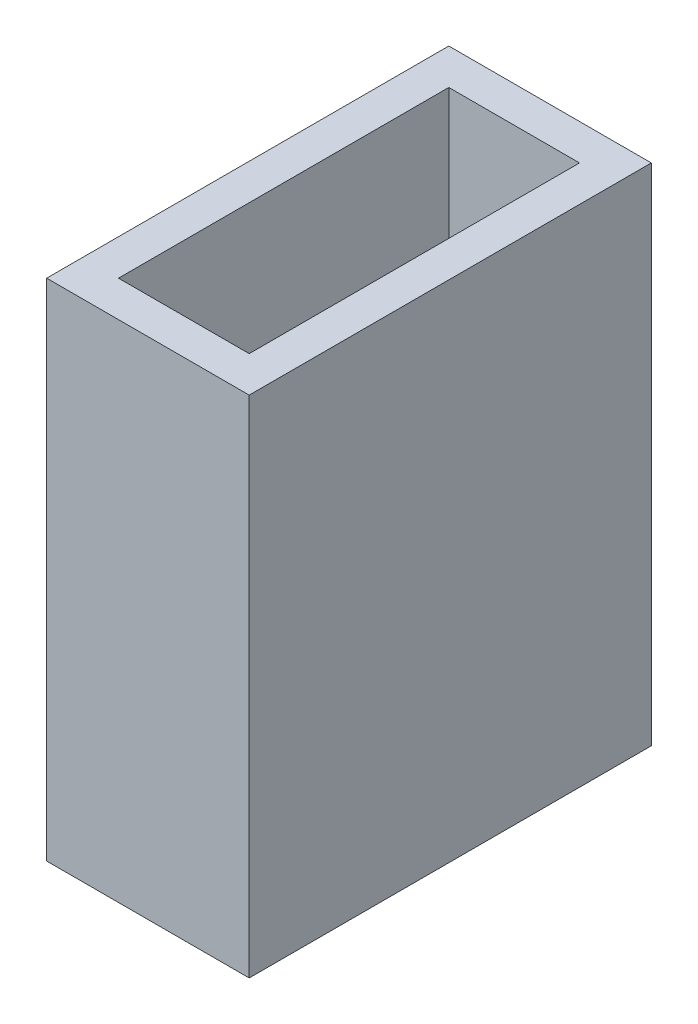
ISO-10303-21;
HEADER;
FILE_DESCRIPTION(('STEP AP214'),'2;1');
FILE_NAME('part.step','',(''),(''),'','','');
FILE_SCHEMA(('AUTOMOTIVE_DESIGN { 1 0 10303 214 1 1 1 1 }'));
ENDSEC;
DATA;
#1=APPLICATION_CONTEXT('core data for automotive mechanical design processes');
#2=APPLICATION_PROTOCOL_DEFINITION('international standard','automotive_design',2000,#1);
#3=PRODUCT_CONTEXT('',#1,'mechanical');
#4=PRODUCT('Part','Part','',(#3));
#5=PRODUCT_RELATED_PRODUCT_CATEGORY('part','',(#4));
#6=PRODUCT_DEFINITION_FORMATION('','',#4);
#7=PRODUCT_DEFINITION_CONTEXT('part definition',#1,'design');
#8=PRODUCT_DEFINITION('design','',#6,#7);
#9=PRODUCT_DEFINITION_SHAPE('','',#8);
#10=(LENGTH_UNIT() NAMED_UNIT(*) SI_UNIT(.MILLI.,.METRE.));
#11=(NAMED_UNIT(*) PLANE_ANGLE_UNIT() SI_UNIT($,.RADIAN.));
#12=(NAMED_UNIT(*) SI_UNIT($,.STERADIAN.) SOLID_ANGLE_UNIT());
#13=UNCERTAINTY_MEASURE_WITH_UNIT(LENGTH_MEASURE(1.E-05),#10,'distance_accuracy_value','');
#14=(GEOMETRIC_REPRESENTATION_CONTEXT(3) GLOBAL_UNCERTAINTY_ASSIGNED_CONTEXT((#13)) GLOBAL_UNIT_ASSIGNED_CONTEXT((#10,
#11,#12)) REPRESENTATION_CONTEXT('',''));
#15=CARTESIAN_POINT('',(0.,0.,0.));
#16=DIRECTION('',(0.,0.,1.));
#17=DIRECTION('',(1.,0.,0.));
#18=AXIS2_PLACEMENT_3D('',#15,#16,#17);
#19=CARTESIAN_POINT('',(13.7040842537851,8.52335897075654,-35.1934434793238));
#20=DIRECTION('',(0.,0.,-1.));
#21=DIRECTION('',(-1.,0.,0.));
#22=AXIS2_PLACEMENT_3D('',#19,#20,#21);
#23=PLANE('',#22);
#24=DIRECTION('',(-1.,0.,0.));
#25=VECTOR('',#24,1.);
#26=CARTESIAN_POINT('',(13.7040842537851,2.17335897773504,-35.1934434793238));
#27=LINE('',#26,#25);
#28=CARTESIAN_POINT('',(15.3483616467974,2.17335897773504,-35.1934434793238));
#29=VERTEX_POINT('',#28);
#30=CARTESIAN_POINT('',(13.7040842537851,2.17335897773504,-35.1934434793238));
#31=VERTEX_POINT('',#30);
#32=EDGE_CURVE('E90',#29,#31,#27,.T.);
#33=ORIENTED_EDGE('',*,*,#32,.T.);
#34=DIRECTION('',(0.,1.,0.));
#35=VECTOR('',#34,1.);
#36=CARTESIAN_POINT('',(13.7040842537851,8.52335897075654,-35.1934434793238));
#37=LINE('',#36,#35);
#38=CARTESIAN_POINT('',(13.7040842537851,8.52335897075654,-35.1934434793238));
#39=VERTEX_POINT('',#38);
#40=EDGE_CURVE('E92',#39,#31,#37,.F.);
#41=ORIENTED_EDGE('',*,*,#40,.F.);
#42=DIRECTION('',(-1.,0.,0.));
#43=VECTOR('',#42,1.);
#44=CARTESIAN_POINT('',(13.7040842537851,8.52335897075654,-35.1934434793238));
#45=LINE('',#44,#43);
#46=CARTESIAN_POINT('',(15.3483616467974,8.52335897075654,-35.1934434793238));
#47=VERTEX_POINT('',#46);
#48=EDGE_CURVE('E20',#39,#47,#45,.F.);
#49=ORIENTED_EDGE('',*,*,#48,.T.);
#50=DIRECTION('',(0.,-1.,0.));
#51=VECTOR('',#50,1.);
#52=CARTESIAN_POINT('',(15.3483616467974,8.52335897075654,-35.1934434793238));
#53=LINE('',#52,#51);
#54=EDGE_CURVE('E97',#29,#47,#53,.F.);
#55=ORIENTED_EDGE('',*,*,#54,.F.);
#56=EDGE_LOOP('',(#33,#41,#49,#55));
#57=FACE_BOUND('',#56,.T.);
#58=ADVANCED_FACE('F17',(#57),#23,.T.);
#59=CARTESIAN_POINT('',(15.3483616467974,8.52335897075654,-39.3483599932868));
#60=DIRECTION('',(0.,0.,1.));
#61=DIRECTION('',(1.,0.,0.));
#62=AXIS2_PLACEMENT_3D('',#59,#60,#61);
#63=PLANE('',#62);
#64=DIRECTION('',(1.,0.,0.));
#65=VECTOR('',#64,1.);
#66=CARTESIAN_POINT('',(15.3483616467974,2.17335897773504,-39.3483599932868));
#67=LINE('',#66,#65);
#68=CARTESIAN_POINT('',(13.7040842537851,2.17335897773504,-39.3483599932868));
#69=VERTEX_POINT('',#68);
#70=CARTESIAN_POINT('',(15.3483616467974,2.17335897773504,-39.3483599932868));
#71=VERTEX_POINT('',#70);
#72=EDGE_CURVE('E114',#69,#71,#67,.T.);
#73=ORIENTED_EDGE('',*,*,#72,.T.);
#74=DIRECTION('',(0.,-1.,0.));
#75=VECTOR('',#74,1.);
#76=CARTESIAN_POINT('',(15.3483616467974,8.52335897075654,-39.3483599932868));
#77=LINE('',#76,#75);
#78=CARTESIAN_POINT('',(15.3483616467974,8.52335897075654,-39.3483599932868));
#79=VERTEX_POINT('',#78);
#80=EDGE_CURVE('E111',#79,#71,#77,.T.);
#81=ORIENTED_EDGE('',*,*,#80,.F.);
#82=DIRECTION('',(1.,0.,0.));
#83=VECTOR('',#82,1.);
#84=CARTESIAN_POINT('',(15.3483616467974,8.52335897075654,-39.3483599932868));
#85=LINE('',#84,#83);
#86=CARTESIAN_POINT('',(13.7040842537851,8.52335897075654,-39.3483599932868));
#87=VERTEX_POINT('',#86);
#88=EDGE_CURVE('E116',#79,#87,#85,.F.);
#89=ORIENTED_EDGE('',*,*,#88,.T.);
#90=DIRECTION('',(0.,1.,0.));
#91=VECTOR('',#90,1.);
#92=CARTESIAN_POINT('',(13.7040842537851,8.52335897075654,-39.3483599932868));
#93=LINE('',#92,#91);
#94=EDGE_CURVE('E96',#69,#87,#93,.T.);
#95=ORIENTED_EDGE('',*,*,#94,.F.);
#96=EDGE_LOOP('',(#73,#81,#89,#95));
#97=FACE_BOUND('',#96,.T.);
#98=ADVANCED_FACE('F119',(#97),#63,.T.);
#99=CARTESIAN_POINT('',(15.3483616467974,8.52335897075654,-35.1934434793238));
#100=DIRECTION('',(-1.,0.,0.));
#101=DIRECTION('',(0.,-1.,0.));
#102=AXIS2_PLACEMENT_3D('',#99,#100,#101);
#103=PLANE('',#102);
#104=DIRECTION('',(0.,0.,1.));
#105=VECTOR('',#104,1.);
#106=CARTESIAN_POINT('',(15.3483616467974,2.17335897773504,-37.2709017363053));
#107=LINE('',#106,#105);
#108=EDGE_CURVE('E124',#29,#71,#107,.F.);
#109=ORIENTED_EDGE('',*,*,#108,.F.);
#110=ORIENTED_EDGE('',*,*,#54,.T.);
#111=DIRECTION('',(0.,0.,1.));
#112=VECTOR('',#111,1.);
#113=CARTESIAN_POINT('',(15.3483616467974,8.52335897075654,-37.2709017363053));
#114=LINE('',#113,#112);
#115=EDGE_CURVE('E89',#79,#47,#114,.T.);
#116=ORIENTED_EDGE('',*,*,#115,.F.);
#117=ORIENTED_EDGE('',*,*,#80,.T.);
#118=EDGE_LOOP('',(#109,#110,#116,#117));
#119=FACE_BOUND('',#118,.T.);
#120=ADVANCED_FACE('F123',(#119),#103,.T.);
#121=CARTESIAN_POINT('',(13.7040842537851,8.52335897075654,-39.3483599932868));
#122=DIRECTION('',(1.,0.,0.));
#123=DIRECTION('',(0.,1.,0.));
#124=AXIS2_PLACEMENT_3D('',#121,#122,#123);
#125=PLANE('',#124);
#126=DIRECTION('',(0.,0.,1.));
#127=VECTOR('',#126,1.);
#128=CARTESIAN_POINT('',(13.7040842537851,2.17335897773504,-37.2709017363053));
#129=LINE('',#128,#127);
#130=EDGE_CURVE('E126',#69,#31,#129,.T.);
#131=ORIENTED_EDGE('',*,*,#130,.F.);
#132=ORIENTED_EDGE('',*,*,#94,.T.);
#133=DIRECTION('',(0.,0.,1.));
#134=VECTOR('',#133,1.);
#135=CARTESIAN_POINT('',(13.7040842537851,8.52335897075654,-37.2709017363053));
#136=LINE('',#135,#134);
#137=EDGE_CURVE('E87',#39,#87,#136,.F.);
#138=ORIENTED_EDGE('',*,*,#137,.F.);
#139=ORIENTED_EDGE('',*,*,#40,.T.);
#140=EDGE_LOOP('',(#131,#132,#138,#139));
#141=FACE_BOUND('',#140,.T.);
#142=ADVANCED_FACE('F100',(#141),#125,.T.);
#143=CARTESIAN_POINT('',(13.2524461891814,8.52335897075654,-34.7418054147201));
#144=DIRECTION('',(-1.,0.,0.));
#145=DIRECTION('',(0.,-1.,0.));
#146=AXIS2_PLACEMENT_3D('',#143,#144,#145);
#147=PLANE('',#146);
#148=DIRECTION('',(0.,0.,1.));
#149=VECTOR('',#148,1.);
#150=CARTESIAN_POINT('',(13.2524461891814,2.17335897773504,-37.2709017363053));
#151=LINE('',#150,#149);
#152=CARTESIAN_POINT('',(13.2524461891814,2.17335897773504,-34.7418054147201));
#153=VERTEX_POINT('',#152);
#154=CARTESIAN_POINT('',(13.2524461891814,2.17335897773504,-39.7999980578905));
#155=VERTEX_POINT('',#154);
#156=EDGE_CURVE('E127',#153,#155,#151,.F.);
#157=ORIENTED_EDGE('',*,*,#156,.F.);
#158=DIRECTION('',(0.,1.,0.));
#159=VECTOR('',#158,1.);
#160=CARTESIAN_POINT('',(13.2524461891814,8.52335897075654,-34.7418054147201));
#161=LINE('',#160,#159);
#162=CARTESIAN_POINT('',(13.2524461891814,8.52335897075654,-34.7418054147201));
#163=VERTEX_POINT('',#162);
#164=EDGE_CURVE('E137',#163,#153,#161,.F.);
#165=ORIENTED_EDGE('',*,*,#164,.F.);
#166=DIRECTION('',(0.,0.,1.));
#167=VECTOR('',#166,1.);
#168=CARTESIAN_POINT('',(13.2524461891814,8.52335897075654,-37.2709017363053));
#169=LINE('',#168,#167);
#170=CARTESIAN_POINT('',(13.2524461891814,8.52335897075654,-39.7999980578905));
#171=VERTEX_POINT('',#170);
#172=EDGE_CURVE('E102',#171,#163,#169,.T.);
#173=ORIENTED_EDGE('',*,*,#172,.F.);
#174=DIRECTION('',(0.,1.,0.));
#175=VECTOR('',#174,1.);
#176=CARTESIAN_POINT('',(13.2524461891814,8.52335897075653,-39.7999980578905));
#177=LINE('',#176,#175);
#178=EDGE_CURVE('E154',#155,#171,#177,.T.);
#179=ORIENTED_EDGE('',*,*,#178,.F.);
#180=EDGE_LOOP('',(#157,#165,#173,#179));
#181=FACE_BOUND('',#180,.T.);
#182=ADVANCED_FACE('F153',(#181),#147,.T.);
#183=CARTESIAN_POINT('',(14.5262229502912,8.52335897075654,-37.2709017363053));
#184=DIRECTION('',(0.,1.,0.));
#185=DIRECTION('',(-1.,0.,0.));
#186=AXIS2_PLACEMENT_3D('',#183,#184,#185);
#187=PLANE('',#186);
#188=ORIENTED_EDGE('',*,*,#88,.F.);
#189=ORIENTED_EDGE('',*,*,#115,.T.);
#190=ORIENTED_EDGE('',*,*,#48,.F.);
#191=ORIENTED_EDGE('',*,*,#137,.T.);
#192=EDGE_LOOP('',(#188,#189,#190,#191));
#193=FACE_BOUND('',#192,.T.);
#194=ORIENTED_EDGE('',*,*,#172,.T.);
#195=DIRECTION('',(1.,0.,0.));
#196=VECTOR('',#195,1.);
#197=CARTESIAN_POINT('',(15.7999997114011,8.52335897075654,-34.7418054147201));
#198=LINE('',#197,#196);
#199=CARTESIAN_POINT('',(15.7999997114011,8.52335897075654,-34.7418054147201));
#200=VERTEX_POINT('',#199);
#201=EDGE_CURVE('E104',#200,#163,#198,.F.);
#202=ORIENTED_EDGE('',*,*,#201,.F.);
#203=DIRECTION('',(0.,0.,1.));
#204=VECTOR('',#203,1.);
#205=CARTESIAN_POINT('',(15.7999997114011,8.52335897075654,-39.7999980578905));
#206=LINE('',#205,#204);
#207=CARTESIAN_POINT('',(15.7999997114011,8.52335897075654,-39.7999980578905));
#208=VERTEX_POINT('',#207);
#209=EDGE_CURVE('E148',#208,#200,#206,.T.);
#210=ORIENTED_EDGE('',*,*,#209,.F.);
#211=DIRECTION('',(-1.,0.,0.));
#212=VECTOR('',#211,1.);
#213=CARTESIAN_POINT('',(13.2524461891814,8.52335897075654,-39.7999980578905));
#214=LINE('',#213,#212);
#215=EDGE_CURVE('E129',#171,#208,#214,.F.);
#216=ORIENTED_EDGE('',*,*,#215,.F.);
#217=EDGE_LOOP('',(#194,#202,#210,#216));
#218=FACE_BOUND('',#217,.T.);
#219=ADVANCED_FACE('F84',(#193,#218),#187,.T.);
#220=CARTESIAN_POINT('',(15.7999997114011,8.52335897075654,-34.7418054147201));
#221=DIRECTION('',(0.,0.,1.));
#222=DIRECTION('',(1.,0.,0.));
#223=AXIS2_PLACEMENT_3D('',#220,#221,#222);
#224=PLANE('',#223);
#225=DIRECTION('',(1.,0.,0.));
#226=VECTOR('',#225,1.);
#227=CARTESIAN_POINT('',(14.5262229502912,2.17335897773504,-34.7418054147201));
#228=LINE('',#227,#226);
#229=CARTESIAN_POINT('',(15.7999997114011,2.17335897773504,-34.7418054147201));
#230=VERTEX_POINT('',#229);
#231=EDGE_CURVE('E131',#230,#153,#228,.F.);
#232=ORIENTED_EDGE('',*,*,#231,.F.);
#233=DIRECTION('',(0.,1.,0.));
#234=VECTOR('',#233,1.);
#235=CARTESIAN_POINT('',(15.7999997114011,8.52335897075654,-34.7418054147201));
#236=LINE('',#235,#234);
#237=EDGE_CURVE('E145',#200,#230,#236,.F.);
#238=ORIENTED_EDGE('',*,*,#237,.F.);
#239=ORIENTED_EDGE('',*,*,#201,.T.);
#240=ORIENTED_EDGE('',*,*,#164,.T.);
#241=EDGE_LOOP('',(#232,#238,#239,#240));
#242=FACE_BOUND('',#241,.T.);
#243=ADVANCED_FACE('F141',(#242),#224,.T.);
#244=CARTESIAN_POINT('',(14.5262229502912,2.17335897773504,-37.2709017363053));
#245=DIRECTION('',(0.,-1.,0.));
#246=DIRECTION('',(1.,0.,0.));
#247=AXIS2_PLACEMENT_3D('',#244,#245,#246);
#248=PLANE('',#247);
#249=ORIENTED_EDGE('',*,*,#72,.F.);
#250=ORIENTED_EDGE('',*,*,#130,.T.);
#251=ORIENTED_EDGE('',*,*,#32,.F.);
#252=ORIENTED_EDGE('',*,*,#108,.T.);
#253=EDGE_LOOP('',(#249,#250,#251,#252));
#254=FACE_BOUND('',#253,.T.);
#255=ORIENTED_EDGE('',*,*,#156,.T.);
#256=DIRECTION('',(-1.,0.,0.));
#257=VECTOR('',#256,1.);
#258=CARTESIAN_POINT('',(13.2524461891814,2.17335897773504,-39.7999980578905));
#259=LINE('',#258,#257);
#260=CARTESIAN_POINT('',(15.7999997114011,2.17335897773504,-39.7999980578905));
#261=VERTEX_POINT('',#260);
#262=EDGE_CURVE('E35',#261,#155,#259,.T.);
#263=ORIENTED_EDGE('',*,*,#262,.F.);
#264=DIRECTION('',(0.,0.,1.));
#265=VECTOR('',#264,1.);
#266=CARTESIAN_POINT('',(15.7999997114011,2.17335897773504,-39.7999980578905));
#267=LINE('',#266,#265);
#268=EDGE_CURVE('E26',#230,#261,#267,.F.);
#269=ORIENTED_EDGE('',*,*,#268,.F.);
#270=ORIENTED_EDGE('',*,*,#231,.T.);
#271=EDGE_LOOP('',(#255,#263,#269,#270));
#272=FACE_BOUND('',#271,.T.);
#273=ADVANCED_FACE('F155',(#254,#272),#248,.T.);
#274=CARTESIAN_POINT('',(13.2524461891814,8.52335897075653,-39.7999980578905));
#275=DIRECTION('',(0.,0.,-1.));
#276=DIRECTION('',(-1.,0.,0.));
#277=AXIS2_PLACEMENT_3D('',#274,#275,#276);
#278=PLANE('',#277);
#279=ORIENTED_EDGE('',*,*,#262,.T.);
#280=ORIENTED_EDGE('',*,*,#178,.T.);
#281=ORIENTED_EDGE('',*,*,#215,.T.);
#282=DIRECTION('',(0.,1.,0.));
#283=VECTOR('',#282,1.);
#284=CARTESIAN_POINT('',(15.7999997114011,8.52335897075654,-39.7999980578905));
#285=LINE('',#284,#283);
#286=EDGE_CURVE('E11',#261,#208,#285,.T.);
#287=ORIENTED_EDGE('',*,*,#286,.F.);
#288=EDGE_LOOP('',(#279,#280,#281,#287));
#289=FACE_BOUND('',#288,.T.);
#290=ADVANCED_FACE('F165',(#289),#278,.T.);
#291=CARTESIAN_POINT('',(15.7999997114011,8.52335897075654,-39.7999980578905));
#292=DIRECTION('',(1.,0.,0.));
#293=DIRECTION('',(0.,1.,0.));
#294=AXIS2_PLACEMENT_3D('',#291,#292,#293);
#295=PLANE('',#294);
#296=ORIENTED_EDGE('',*,*,#268,.T.);
#297=ORIENTED_EDGE('',*,*,#286,.T.);
#298=ORIENTED_EDGE('',*,*,#209,.T.);
#299=ORIENTED_EDGE('',*,*,#237,.T.);
#300=EDGE_LOOP('',(#296,#297,#298,#299));
#301=FACE_BOUND('',#300,.T.);
#302=ADVANCED_FACE('F159',(#301),#295,.T.);
#303=CLOSED_SHELL('',(#58,#98,#120,#142,#182,#219,#243,#273,#290,#302));
#304=MANIFOLD_SOLID_BREP('B1',#303);
#305=ADVANCED_BREP_SHAPE_REPRESENTATION('',(#18,#304),#14);
#306=SHAPE_DEFINITION_REPRESENTATION(#9,#305);
ENDSEC;
END-ISO-10303-21;
